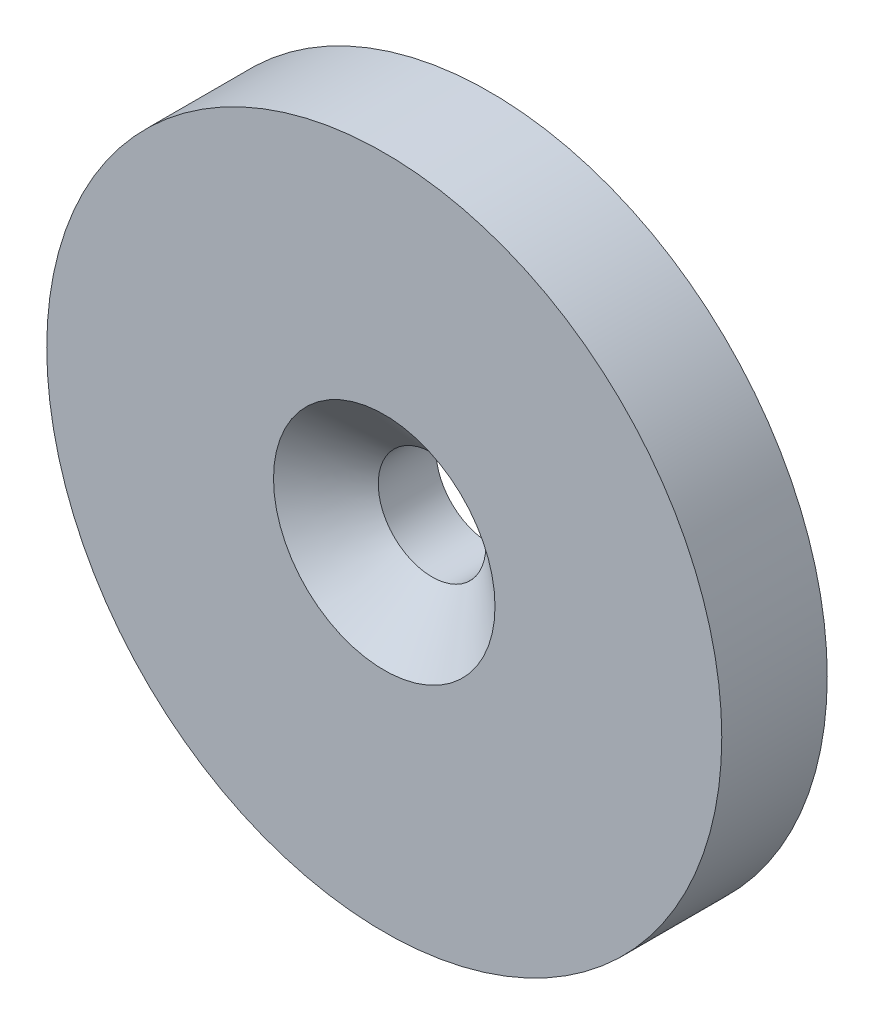
ISO-10303-21;
HEADER;
FILE_DESCRIPTION(('STEP AP214'),'2;1');
FILE_NAME('part.step','',(''),(''),'','','');
FILE_SCHEMA(('AUTOMOTIVE_DESIGN { 1 0 10303 214 1 1 1 1 }'));
ENDSEC;
DATA;
#1=APPLICATION_CONTEXT('core data for automotive mechanical design processes');
#2=APPLICATION_PROTOCOL_DEFINITION('international standard','automotive_design',2000,#1);
#3=PRODUCT_CONTEXT('',#1,'mechanical');
#4=PRODUCT('Part','Part','',(#3));
#5=PRODUCT_RELATED_PRODUCT_CATEGORY('part','',(#4));
#6=PRODUCT_DEFINITION_FORMATION('','',#4);
#7=PRODUCT_DEFINITION_CONTEXT('part definition',#1,'design');
#8=PRODUCT_DEFINITION('design','',#6,#7);
#9=PRODUCT_DEFINITION_SHAPE('','',#8);
#10=(LENGTH_UNIT() NAMED_UNIT(*) SI_UNIT(.MILLI.,.METRE.));
#11=(NAMED_UNIT(*) PLANE_ANGLE_UNIT() SI_UNIT($,.RADIAN.));
#12=(NAMED_UNIT(*) SI_UNIT($,.STERADIAN.) SOLID_ANGLE_UNIT());
#13=UNCERTAINTY_MEASURE_WITH_UNIT(LENGTH_MEASURE(1.E-05),#10,'distance_accuracy_value','');
#14=(GEOMETRIC_REPRESENTATION_CONTEXT(3) GLOBAL_UNCERTAINTY_ASSIGNED_CONTEXT((#13)) GLOBAL_UNIT_ASSIGNED_CONTEXT((#10,
#11,#12)) REPRESENTATION_CONTEXT('',''));
#15=CARTESIAN_POINT('',(0.,0.,0.));
#16=DIRECTION('',(0.,0.,1.));
#17=DIRECTION('',(1.,0.,0.));
#18=AXIS2_PLACEMENT_3D('',#15,#16,#17);
#19=CARTESIAN_POINT('',(-29.5037451211291,20.7668110918544,5.));
#20=DIRECTION('',(0.,0.,-1.));
#21=DIRECTION('',(-1.,0.,0.));
#22=AXIS2_PLACEMENT_3D('',#19,#20,#21);
#23=CYLINDRICAL_SURFACE('',#22,16.);
#24=CARTESIAN_POINT('',(-29.5037451211291,20.7668110918544,5.));
#25=DIRECTION('',(0.,0.,1.));
#26=DIRECTION('',(1.,0.,0.));
#27=AXIS2_PLACEMENT_3D('',#24,#25,#26);
#28=CIRCLE('',#27,16.);
#29=CARTESIAN_POINT('',(-13.5037451211291,20.7668110918544,5.));
#30=VERTEX_POINT('',#29);
#31=EDGE_CURVE('E10',#30,#30,#28,.T.);
#32=ORIENTED_EDGE('',*,*,#31,.F.);
#33=EDGE_LOOP('',(#32));
#34=FACE_BOUND('',#33,.T.);
#35=CARTESIAN_POINT('',(-29.5037451211291,20.7668110918544,0.));
#36=DIRECTION('',(0.,0.,1.));
#37=DIRECTION('',(1.,0.,0.));
#38=AXIS2_PLACEMENT_3D('',#35,#36,#37);
#39=CIRCLE('',#38,16.);
#40=CARTESIAN_POINT('',(-13.5037451211291,20.7668110918544,0.));
#41=VERTEX_POINT('',#40);
#42=EDGE_CURVE('E38',#41,#41,#39,.T.);
#43=ORIENTED_EDGE('',*,*,#42,.T.);
#44=EDGE_LOOP('',(#43));
#45=FACE_BOUND('',#44,.T.);
#46=ADVANCED_FACE('F35',(#34,#45),#23,.T.);
#47=CARTESIAN_POINT('',(-29.5037451211291,20.7668110918544,5.));
#48=DIRECTION('',(0.,0.,1.));
#49=DIRECTION('',(1.,0.,0.));
#50=AXIS2_PLACEMENT_3D('',#47,#48,#49);
#51=PLANE('',#50);
#52=CARTESIAN_POINT('',(-29.5037451211291,20.7668110918544,5.));
#53=DIRECTION('',(0.,0.,1.));
#54=DIRECTION('',(1.,0.,0.));
#55=AXIS2_PLACEMENT_3D('',#52,#53,#54);
#56=CIRCLE('',#55,5.250000041);
#57=CARTESIAN_POINT('',(-24.2537450801291,20.7668110918544,5.));
#58=VERTEX_POINT('',#57);
#59=EDGE_CURVE('E52',#58,#58,#56,.T.);
#60=ORIENTED_EDGE('',*,*,#59,.F.);
#61=EDGE_LOOP('',(#60));
#62=FACE_BOUND('',#61,.T.);
#63=ORIENTED_EDGE('',*,*,#31,.T.);
#64=EDGE_LOOP('',(#63));
#65=FACE_BOUND('',#64,.T.);
#66=ADVANCED_FACE('F58',(#62,#65),#51,.T.);
#67=CARTESIAN_POINT('',(-29.5037451211291,20.7668110918544,0.));
#68=DIRECTION('',(0.,0.,1.));
#69=DIRECTION('',(1.,0.,0.));
#70=AXIS2_PLACEMENT_3D('',#67,#68,#69);
#71=PLANE('',#70);
#72=CARTESIAN_POINT('',(-29.5037451211291,20.7668110918544,0.));
#73=DIRECTION('',(0.,0.,1.));
#74=DIRECTION('',(1.,0.,0.));
#75=AXIS2_PLACEMENT_3D('',#72,#73,#74);
#76=CIRCLE('',#75,2.54999998);
#77=CARTESIAN_POINT('',(-26.9537451411291,20.7668110918544,0.));
#78=VERTEX_POINT('',#77);
#79=EDGE_CURVE('E45',#78,#78,#76,.T.);
#80=ORIENTED_EDGE('',*,*,#79,.T.);
#81=EDGE_LOOP('',(#80));
#82=FACE_BOUND('',#81,.T.);
#83=ORIENTED_EDGE('',*,*,#42,.F.);
#84=EDGE_LOOP('',(#83));
#85=FACE_BOUND('',#84,.T.);
#86=ADVANCED_FACE('F60',(#82,#85),#71,.F.);
#87=CARTESIAN_POINT('',(-29.5037451211291,20.7668110918544,5.));
#88=DIRECTION('',(0.,0.,1.));
#89=DIRECTION('',(1.,0.,0.));
#90=AXIS2_PLACEMENT_3D('',#87,#88,#89);
#91=CYLINDRICAL_SURFACE('',#90,2.54999998);
#92=ORIENTED_EDGE('',*,*,#79,.F.);
#93=EDGE_LOOP('',(#92));
#94=FACE_BOUND('',#93,.T.);
#95=CARTESIAN_POINT('',(-29.5037451211291,20.7668110918544,2.73443094463626));
#96=DIRECTION('',(0.,0.,1.));
#97=DIRECTION('',(1.,0.,0.));
#98=AXIS2_PLACEMENT_3D('',#95,#96,#97);
#99=CIRCLE('',#98,2.54999998);
#100=CARTESIAN_POINT('',(-26.9537451411291,20.7668110918544,2.73443094463626));
#101=VERTEX_POINT('',#100);
#102=EDGE_CURVE('E49',#101,#101,#99,.T.);
#103=ORIENTED_EDGE('',*,*,#102,.T.);
#104=EDGE_LOOP('',(#103));
#105=FACE_BOUND('',#104,.T.);
#106=ADVANCED_FACE('F66',(#94,#105),#91,.F.);
#107=CARTESIAN_POINT('',(-29.5037451211291,20.7668110918544,5.));
#108=DIRECTION('',(0.,0.,1.));
#109=DIRECTION('',(1.,0.,0.));
#110=AXIS2_PLACEMENT_3D('',#107,#108,#109);
#111=CONICAL_SURFACE('',#110,5.250000041,0.872664625997165);
#112=ORIENTED_EDGE('',*,*,#102,.F.);
#113=EDGE_LOOP('',(#112));
#114=FACE_BOUND('',#113,.T.);
#115=ORIENTED_EDGE('',*,*,#59,.T.);
#116=EDGE_LOOP('',(#115));
#117=FACE_BOUND('',#116,.T.);
#118=ADVANCED_FACE('F56',(#114,#117),#111,.F.);
#119=CLOSED_SHELL('',(#46,#66,#86,#106,#118));
#120=MANIFOLD_SOLID_BREP('B2',#119);
#121=ADVANCED_BREP_SHAPE_REPRESENTATION('',(#18,#120),#14);
#122=SHAPE_DEFINITION_REPRESENTATION(#9,#121);
ENDSEC;
END-ISO-10303-21;
